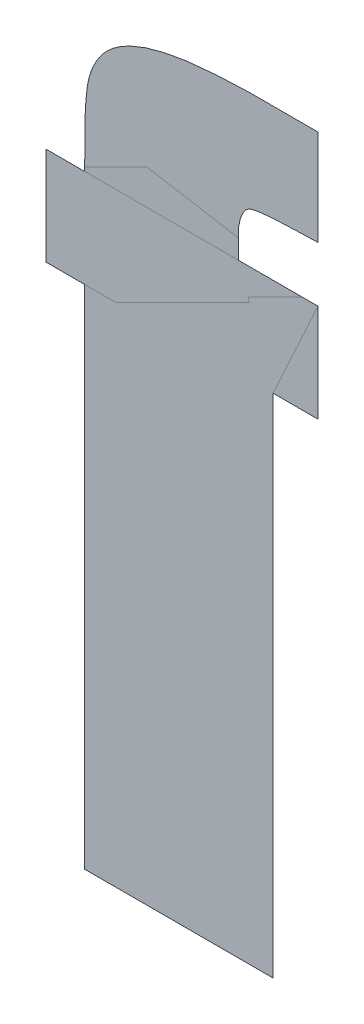
ISO-10303-21;
HEADER;
FILE_DESCRIPTION(('STEP AP214'),'2;1');
FILE_NAME('part.step','',(''),(''),'','','');
FILE_SCHEMA(('AUTOMOTIVE_DESIGN { 1 0 10303 214 1 1 1 1 }'));
ENDSEC;
DATA;
#1=APPLICATION_CONTEXT('core data for automotive mechanical design processes');
#2=APPLICATION_PROTOCOL_DEFINITION('international standard','automotive_design',2000,#1);
#3=PRODUCT_CONTEXT('',#1,'mechanical');
#4=PRODUCT('Part','Part','',(#3));
#5=PRODUCT_RELATED_PRODUCT_CATEGORY('part','',(#4));
#6=PRODUCT_DEFINITION_FORMATION('','',#4);
#7=PRODUCT_DEFINITION_CONTEXT('part definition',#1,'design');
#8=PRODUCT_DEFINITION('design','',#6,#7);
#9=PRODUCT_DEFINITION_SHAPE('','',#8);
#10=(LENGTH_UNIT() NAMED_UNIT(*) SI_UNIT(.MILLI.,.METRE.));
#11=(NAMED_UNIT(*) PLANE_ANGLE_UNIT() SI_UNIT($,.RADIAN.));
#12=(NAMED_UNIT(*) SI_UNIT($,.STERADIAN.) SOLID_ANGLE_UNIT());
#13=UNCERTAINTY_MEASURE_WITH_UNIT(LENGTH_MEASURE(1.E-05),#10,'distance_accuracy_value','');
#14=(GEOMETRIC_REPRESENTATION_CONTEXT(3) GLOBAL_UNCERTAINTY_ASSIGNED_CONTEXT((#13)) GLOBAL_UNIT_ASSIGNED_CONTEXT((#10,
#11,#12)) REPRESENTATION_CONTEXT('',''));
#15=CARTESIAN_POINT('',(0.,0.,0.));
#16=DIRECTION('',(0.,0.,1.));
#17=DIRECTION('',(1.,0.,0.));
#18=AXIS2_PLACEMENT_3D('',#15,#16,#17);
#19=CARTESIAN_POINT('',(6.58973938199,0.805634359142,0.001668));
#20=DIRECTION('',(0.,0.,1.));
#21=DIRECTION('',(1.,0.,0.));
#22=AXIS2_PLACEMENT_3D('',#19,#20,#21);
#23=PLANE('',#22);
#24=CARTESIAN_POINT('',(6.603764664777,0.869123819549,0.001668));
#25=DIRECTION('',(0.,1.,0.));
#26=VECTOR('',#25,1.);
#27=LINE('',#24,#26);
#28=CARTESIAN_POINT('',(6.603764664777,0.869123819549,0.0015));
#29=VERTEX_POINT('',#28);
#30=CARTESIAN_POINT('',(6.603764664777,0.874863081126,0.0015));
#31=VERTEX_POINT('',#30);
#32=EDGE_CURVE('E96',#29,#31,#27,.T.);
#33=ORIENTED_EDGE('',*,*,#32,.T.);
#34=CARTESIAN_POINT('',(6.603764664777,0.874863081126,0.001668));
#35=CARTESIAN_POINT('',(6.60400106327337,0.881849509565001,0.001668));
#36=CARTESIAN_POINT('',(6.6068874982825,0.8838939780205,0.001668));
#37=CARTESIAN_POINT('',(6.60915152775713,0.885497595226,0.001668));
#38=CARTESIAN_POINT('',(6.627396918332,0.885497595226,0.001668));
#39=B_SPLINE_CURVE_WITH_KNOTS('',2,(#34,#35,#36,#37,#38),.UNSPECIFIED.,.F.,.F.,(3,2,3),(0.,0.5,
1.),.UNSPECIFIED.);
#40=CARTESIAN_POINT('',(6.627396918332,0.885497595226,0.0015));
#41=VERTEX_POINT('',#40);
#42=EDGE_CURVE('E28',#31,#41,#39,.T.);
#43=ORIENTED_EDGE('',*,*,#42,.T.);
#44=CARTESIAN_POINT('',(6.627396918332,0.885497595226,0.001668));
#45=DIRECTION('',(0.,1.,0.));
#46=VECTOR('',#45,1.);
#47=LINE('',#44,#46);
#48=CARTESIAN_POINT('',(6.627396918332,0.913856299492,0.0015));
#49=VERTEX_POINT('',#48);
#50=EDGE_CURVE('E11',#41,#49,#47,.T.);
#51=ORIENTED_EDGE('',*,*,#50,.T.);
#52=CARTESIAN_POINT('',(6.627396918332,0.913856299492,0.001668));
#53=DIRECTION('',(-1.,0.,0.));
#54=VECTOR('',#53,1.);
#55=LINE('',#52,#54);
#56=CARTESIAN_POINT('',(6.606971899188,0.913856299492,0.0015));
#57=VERTEX_POINT('',#56);
#58=EDGE_CURVE('E74',#49,#57,#55,.T.);
#59=ORIENTED_EDGE('',*,*,#58,.T.);
#60=CARTESIAN_POINT('',(6.606971899188,0.913856299492,0.001668));
#61=CARTESIAN_POINT('',(6.57603508014042,0.913856299492,0.001668));
#62=CARTESIAN_POINT('',(6.565615455467,0.9041501953535,0.001668));
#63=CARTESIAN_POINT('',(6.56100385531042,0.899854390776288,0.001668));
#64=CARTESIAN_POINT('',(6.559454189362,0.893262478537,0.001668));
#65=CARTESIAN_POINT('',(6.558188175779,0.887877156338115,0.001668));
#66=CARTESIAN_POINT('',(6.558188175779,0.869123819549,0.001668));
#67=B_SPLINE_CURVE_WITH_KNOTS('',2,(#60,#61,#62,#63,#64,#65,#66),.UNSPECIFIED.,.F.,.F.,(3,2,2,
3),(0.,0.5,0.75,1.),.UNSPECIFIED.);
#68=CARTESIAN_POINT('',(6.558188175779,0.869123819549,0.0015));
#69=VERTEX_POINT('',#68);
#70=EDGE_CURVE('E71',#57,#69,#67,.T.);
#71=ORIENTED_EDGE('',*,*,#70,.T.);
#72=CARTESIAN_POINT('',(6.558188175779,0.869123819549,0.001668));
#73=DIRECTION('',(-1.,0.,0.));
#74=VECTOR('',#73,1.);
#75=LINE('',#72,#74);
#76=CARTESIAN_POINT('',(6.546709652624,0.869123819549,0.0015));
#77=VERTEX_POINT('',#76);
#78=EDGE_CURVE('E183',#69,#77,#75,.T.);
#79=ORIENTED_EDGE('',*,*,#78,.T.);
#80=CARTESIAN_POINT('',(6.546709652624,0.869123819549,0.001668));
#81=DIRECTION('',(0.,-1.,0.));
#82=VECTOR('',#81,1.);
#83=LINE('',#80,#82);
#84=CARTESIAN_POINT('',(6.546709652624,0.840089908038,0.0015));
#85=VERTEX_POINT('',#84);
#86=EDGE_CURVE('E192',#77,#85,#83,.T.);
#87=ORIENTED_EDGE('',*,*,#86,.T.);
#88=CARTESIAN_POINT('',(6.546709652624,0.840089908038,0.001668));
#89=DIRECTION('',(1.,0.,0.));
#90=VECTOR('',#89,1.);
#91=LINE('',#88,#90);
#92=CARTESIAN_POINT('',(6.558188175779,0.840089908038,0.0015));
#93=VERTEX_POINT('',#92);
#94=EDGE_CURVE('E193',#85,#93,#91,.T.);
#95=ORIENTED_EDGE('',*,*,#94,.T.);
#96=CARTESIAN_POINT('',(6.558188175779,0.840089908038,0.001668));
#97=DIRECTION('',(0.,-1.,0.));
#98=VECTOR('',#97,1.);
#99=LINE('',#96,#98);
#100=CARTESIAN_POINT('',(6.558188175779,0.689856296154,0.0015));
#101=VERTEX_POINT('',#100);
#102=EDGE_CURVE('E194',#93,#101,#99,.T.);
#103=ORIENTED_EDGE('',*,*,#102,.T.);
#104=CARTESIAN_POINT('',(6.558188175779,0.689856296154,0.001668));
#105=DIRECTION('',(1.,0.,0.));
#106=VECTOR('',#105,1.);
#107=LINE('',#104,#106);
#108=CARTESIAN_POINT('',(6.614061575255,0.689856296154,0.0015));
#109=VERTEX_POINT('',#108);
#110=EDGE_CURVE('E196',#101,#109,#107,.T.);
#111=ORIENTED_EDGE('',*,*,#110,.T.);
#112=CARTESIAN_POINT('',(6.614061575255,0.689856296154,0.001668));
#113=DIRECTION('',(0.,1.,0.));
#114=VECTOR('',#113,1.);
#115=LINE('',#112,#114);
#116=CARTESIAN_POINT('',(6.614061575255,0.840089908038,0.0015));
#117=VERTEX_POINT('',#116);
#118=EDGE_CURVE('E198',#109,#117,#115,.T.);
#119=ORIENTED_EDGE('',*,*,#118,.T.);
#120=CARTESIAN_POINT('',(6.614061575255,0.840089908038,0.001668));
#121=DIRECTION('',(1.,0.,0.));
#122=VECTOR('',#121,1.);
#123=LINE('',#120,#122);
#124=CARTESIAN_POINT('',(6.627396918332,0.840089908038,0.0015));
#125=VERTEX_POINT('',#124);
#126=EDGE_CURVE('E200',#117,#125,#123,.T.);
#127=ORIENTED_EDGE('',*,*,#126,.T.);
#128=CARTESIAN_POINT('',(6.627396918332,0.840089908038,0.001668));
#129=DIRECTION('',(0.,1.,0.));
#130=VECTOR('',#129,1.);
#131=LINE('',#128,#130);
#132=CARTESIAN_POINT('',(6.627396918332,0.869123819549,0.0015));
#133=VERTEX_POINT('',#132);
#134=EDGE_CURVE('E202',#125,#133,#131,.T.);
#135=ORIENTED_EDGE('',*,*,#134,.T.);
#136=CARTESIAN_POINT('',(6.627396918332,0.869123819549,0.001668));
#137=DIRECTION('',(-1.,0.,0.));
#138=VECTOR('',#137,1.);
#139=LINE('',#136,#138);
#140=EDGE_CURVE('E204',#133,#29,#139,.T.);
#141=ORIENTED_EDGE('',*,*,#140,.T.);
#142=EDGE_LOOP('',(#33,#43,#51,#59,#71,#79,#87,#95,#103,#111,#119,#127,#135,#141));
#143=FACE_BOUND('',#142,.T.);
#144=ADVANCED_FACE('F17',(#143),#23,.T.);
#145=CARTESIAN_POINT('',(6.58973938199,0.805634359142,0.001332));
#146=DIRECTION('',(0.,0.,1.));
#147=DIRECTION('',(1.,0.,0.));
#148=AXIS2_PLACEMENT_3D('',#145,#146,#147);
#149=PLANE('',#148);
#150=ORIENTED_EDGE('',*,*,#42,.F.);
#151=ORIENTED_EDGE('',*,*,#32,.F.);
#152=ORIENTED_EDGE('',*,*,#140,.F.);
#153=ORIENTED_EDGE('',*,*,#134,.F.);
#154=ORIENTED_EDGE('',*,*,#126,.F.);
#155=ORIENTED_EDGE('',*,*,#118,.F.);
#156=ORIENTED_EDGE('',*,*,#110,.F.);
#157=ORIENTED_EDGE('',*,*,#102,.F.);
#158=ORIENTED_EDGE('',*,*,#94,.F.);
#159=ORIENTED_EDGE('',*,*,#86,.F.);
#160=ORIENTED_EDGE('',*,*,#78,.F.);
#161=ORIENTED_EDGE('',*,*,#70,.F.);
#162=ORIENTED_EDGE('',*,*,#58,.F.);
#163=ORIENTED_EDGE('',*,*,#50,.F.);
#164=EDGE_LOOP('',(#150,#151,#152,#153,#154,#155,#156,#157,#158,#159,#160,#161,#162,#163));
#165=FACE_BOUND('',#164,.T.);
#166=ADVANCED_FACE('F76',(#165),#149,.F.);
#167=CLOSED_SHELL('',(#144,#166));
#168=MANIFOLD_SOLID_BREP('B1',#167);
#169=ADVANCED_BREP_SHAPE_REPRESENTATION('',(#18,#168),#14);
#170=SHAPE_DEFINITION_REPRESENTATION(#9,#169);
ENDSEC;
END-ISO-10303-21;
